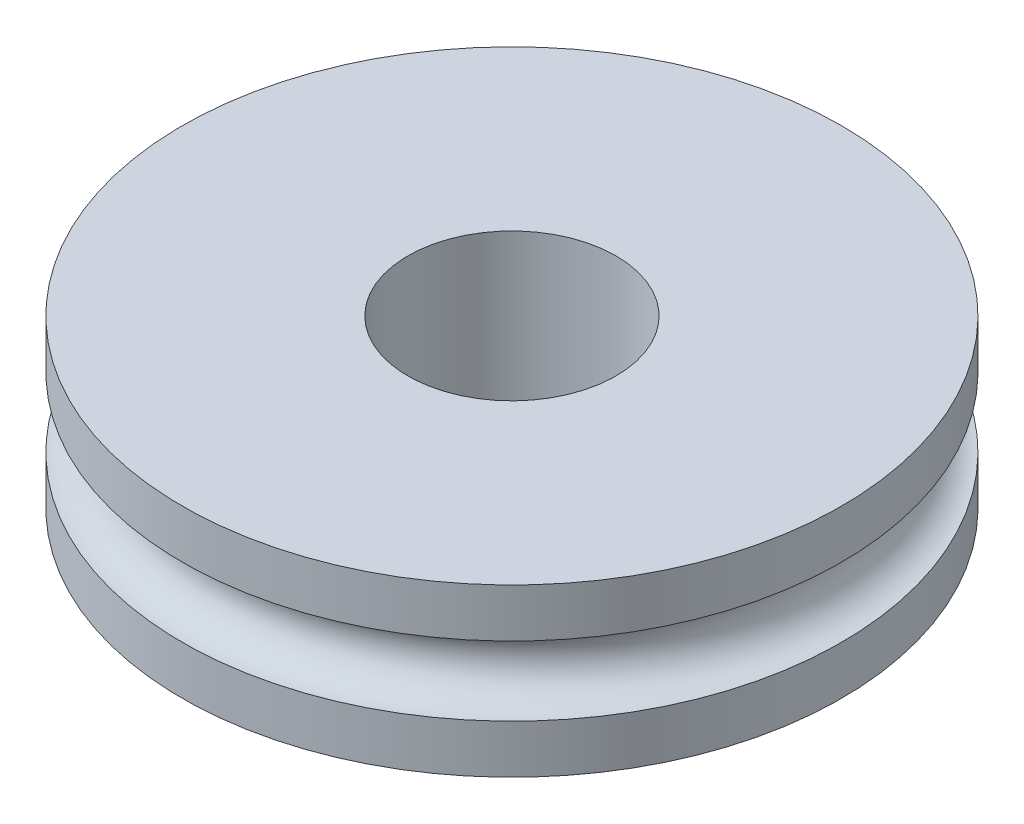
ISO-10303-21;
HEADER;
FILE_DESCRIPTION(('STEP AP214'),'2;1');
FILE_NAME('part.step','',(''),(''),'','','');
FILE_SCHEMA(('AUTOMOTIVE_DESIGN { 1 0 10303 214 1 1 1 1 }'));
ENDSEC;
DATA;
#1=APPLICATION_CONTEXT('core data for automotive mechanical design processes');
#2=APPLICATION_PROTOCOL_DEFINITION('international standard','automotive_design',2000,#1);
#3=PRODUCT_CONTEXT('',#1,'mechanical');
#4=PRODUCT('Part','Part','',(#3));
#5=PRODUCT_RELATED_PRODUCT_CATEGORY('part','',(#4));
#6=PRODUCT_DEFINITION_FORMATION('','',#4);
#7=PRODUCT_DEFINITION_CONTEXT('part definition',#1,'design');
#8=PRODUCT_DEFINITION('design','',#6,#7);
#9=PRODUCT_DEFINITION_SHAPE('','',#8);
#10=(LENGTH_UNIT() NAMED_UNIT(*) SI_UNIT(.MILLI.,.METRE.));
#11=(NAMED_UNIT(*) PLANE_ANGLE_UNIT() SI_UNIT($,.RADIAN.));
#12=(NAMED_UNIT(*) SI_UNIT($,.STERADIAN.) SOLID_ANGLE_UNIT());
#13=UNCERTAINTY_MEASURE_WITH_UNIT(LENGTH_MEASURE(1.E-05),#10,'distance_accuracy_value','');
#14=(GEOMETRIC_REPRESENTATION_CONTEXT(3) GLOBAL_UNCERTAINTY_ASSIGNED_CONTEXT((#13)) GLOBAL_UNIT_ASSIGNED_CONTEXT((#10,
#11,#12)) REPRESENTATION_CONTEXT('',''));
#15=CARTESIAN_POINT('',(0.,0.,0.));
#16=DIRECTION('',(0.,0.,1.));
#17=DIRECTION('',(1.,0.,0.));
#18=AXIS2_PLACEMENT_3D('',#15,#16,#17);
#19=CARTESIAN_POINT('',(1.5,1.2,0.));
#20=DIRECTION('',(0.,1.,0.));
#21=DIRECTION('',(0.,0.,1.));
#22=AXIS2_PLACEMENT_3D('',#19,#20,#21);
#23=PLANE('',#22);
#24=CARTESIAN_POINT('',(0.,1.2,0.));
#25=DIRECTION('',(0.,-1.,0.));
#26=DIRECTION('',(0.,0.,-1.));
#27=AXIS2_PLACEMENT_3D('',#24,#25,#26);
#28=CIRCLE('',#27,1.5);
#29=CARTESIAN_POINT('',(0.,1.2,-1.5));
#30=VERTEX_POINT('',#29);
#31=EDGE_CURVE('E10',#30,#30,#28,.T.);
#32=ORIENTED_EDGE('',*,*,#31,.T.);
#33=EDGE_LOOP('',(#32));
#34=FACE_BOUND('',#33,.T.);
#35=CARTESIAN_POINT('',(0.,1.2,0.));
#36=DIRECTION('',(0.,-1.,0.));
#37=DIRECTION('',(0.,0.,-1.));
#38=AXIS2_PLACEMENT_3D('',#35,#36,#37);
#39=CIRCLE('',#38,4.75);
#40=CARTESIAN_POINT('',(0.,1.2,-4.75));
#41=VERTEX_POINT('',#40);
#42=EDGE_CURVE('E54',#41,#41,#39,.T.);
#43=ORIENTED_EDGE('',*,*,#42,.F.);
#44=EDGE_LOOP('',(#43));
#45=FACE_BOUND('',#44,.T.);
#46=ADVANCED_FACE('F32',(#34,#45),#23,.T.);
#47=CARTESIAN_POINT('',(0.,0.,0.));
#48=DIRECTION('',(0.,-1.,0.));
#49=DIRECTION('',(0.,0.,-1.));
#50=AXIS2_PLACEMENT_3D('',#47,#48,#49);
#51=CYLINDRICAL_SURFACE('',#50,1.5);
#52=CARTESIAN_POINT('',(0.,-1.2,0.));
#53=DIRECTION('',(0.,-1.,0.));
#54=DIRECTION('',(0.,0.,-1.));
#55=AXIS2_PLACEMENT_3D('',#52,#53,#54);
#56=CIRCLE('',#55,1.5);
#57=CARTESIAN_POINT('',(0.,-1.2,-1.5));
#58=VERTEX_POINT('',#57);
#59=EDGE_CURVE('E38',#58,#58,#56,.T.);
#60=ORIENTED_EDGE('',*,*,#59,.T.);
#61=EDGE_LOOP('',(#60));
#62=FACE_BOUND('',#61,.T.);
#63=ORIENTED_EDGE('',*,*,#31,.F.);
#64=EDGE_LOOP('',(#63));
#65=FACE_BOUND('',#64,.T.);
#66=ADVANCED_FACE('F62',(#62,#65),#51,.F.);
#67=CARTESIAN_POINT('',(1.5,-1.2,0.));
#68=DIRECTION('',(0.,-1.,0.));
#69=DIRECTION('',(0.,0.,-1.));
#70=AXIS2_PLACEMENT_3D('',#67,#68,#69);
#71=PLANE('',#70);
#72=CARTESIAN_POINT('',(0.,-1.2,0.));
#73=DIRECTION('',(0.,-1.,0.));
#74=DIRECTION('',(0.,0.,-1.));
#75=AXIS2_PLACEMENT_3D('',#72,#73,#74);
#76=CIRCLE('',#75,4.75);
#77=CARTESIAN_POINT('',(0.,-1.2,-4.75));
#78=VERTEX_POINT('',#77);
#79=EDGE_CURVE('E42',#78,#78,#76,.T.);
#80=ORIENTED_EDGE('',*,*,#79,.T.);
#81=EDGE_LOOP('',(#80));
#82=FACE_BOUND('',#81,.T.);
#83=ORIENTED_EDGE('',*,*,#59,.F.);
#84=EDGE_LOOP('',(#83));
#85=FACE_BOUND('',#84,.T.);
#86=ADVANCED_FACE('F66',(#82,#85),#71,.T.);
#87=CARTESIAN_POINT('',(0.,0.,0.));
#88=DIRECTION('',(0.,-1.,0.));
#89=DIRECTION('',(0.,0.,-1.));
#90=AXIS2_PLACEMENT_3D('',#87,#88,#89);
#91=CYLINDRICAL_SURFACE('',#90,4.75);
#92=CARTESIAN_POINT('',(0.,-0.5,0.));
#93=DIRECTION('',(0.,-1.,0.));
#94=DIRECTION('',(0.,0.,-1.));
#95=AXIS2_PLACEMENT_3D('',#92,#93,#94);
#96=CIRCLE('',#95,4.75);
#97=CARTESIAN_POINT('',(0.,-0.5,-4.75));
#98=VERTEX_POINT('',#97);
#99=EDGE_CURVE('E46',#98,#98,#96,.T.);
#100=ORIENTED_EDGE('',*,*,#99,.T.);
#101=EDGE_LOOP('',(#100));
#102=FACE_BOUND('',#101,.T.);
#103=ORIENTED_EDGE('',*,*,#79,.F.);
#104=EDGE_LOOP('',(#103));
#105=FACE_BOUND('',#104,.T.);
#106=ADVANCED_FACE('F70',(#102,#105),#91,.T.);
#107=CARTESIAN_POINT('',(0.,0.,0.));
#108=DIRECTION('',(0.,-1.,0.));
#109=DIRECTION('',(0.,0.,-1.));
#110=AXIS2_PLACEMENT_3D('',#107,#108,#109);
#111=TOROIDAL_SURFACE('',#110,4.75,0.5);
#112=CARTESIAN_POINT('',(0.,0.5,0.));
#113=DIRECTION('',(0.,-1.,0.));
#114=DIRECTION('',(0.,0.,-1.));
#115=AXIS2_PLACEMENT_3D('',#112,#113,#114);
#116=CIRCLE('',#115,4.75);
#117=CARTESIAN_POINT('',(0.,0.5,-4.75));
#118=VERTEX_POINT('',#117);
#119=EDGE_CURVE('E51',#118,#118,#116,.T.);
#120=ORIENTED_EDGE('',*,*,#119,.T.);
#121=EDGE_LOOP('',(#120));
#122=FACE_BOUND('',#121,.T.);
#123=ORIENTED_EDGE('',*,*,#99,.F.);
#124=EDGE_LOOP('',(#123));
#125=FACE_BOUND('',#124,.T.);
#126=ADVANCED_FACE('F77',(#122,#125),#111,.F.);
#127=CARTESIAN_POINT('',(0.,0.,0.));
#128=DIRECTION('',(0.,-1.,0.));
#129=DIRECTION('',(0.,0.,-1.));
#130=AXIS2_PLACEMENT_3D('',#127,#128,#129);
#131=CYLINDRICAL_SURFACE('',#130,4.75);
#132=ORIENTED_EDGE('',*,*,#42,.T.);
#133=EDGE_LOOP('',(#132));
#134=FACE_BOUND('',#133,.T.);
#135=ORIENTED_EDGE('',*,*,#119,.F.);
#136=EDGE_LOOP('',(#135));
#137=FACE_BOUND('',#136,.T.);
#138=ADVANCED_FACE('F58',(#134,#137),#131,.T.);
#139=CLOSED_SHELL('',(#46,#66,#86,#106,#126,#138));
#140=MANIFOLD_SOLID_BREP('B2',#139);
#141=ADVANCED_BREP_SHAPE_REPRESENTATION('',(#18,#140),#14);
#142=SHAPE_DEFINITION_REPRESENTATION(#9,#141);
ENDSEC;
END-ISO-10303-21;
